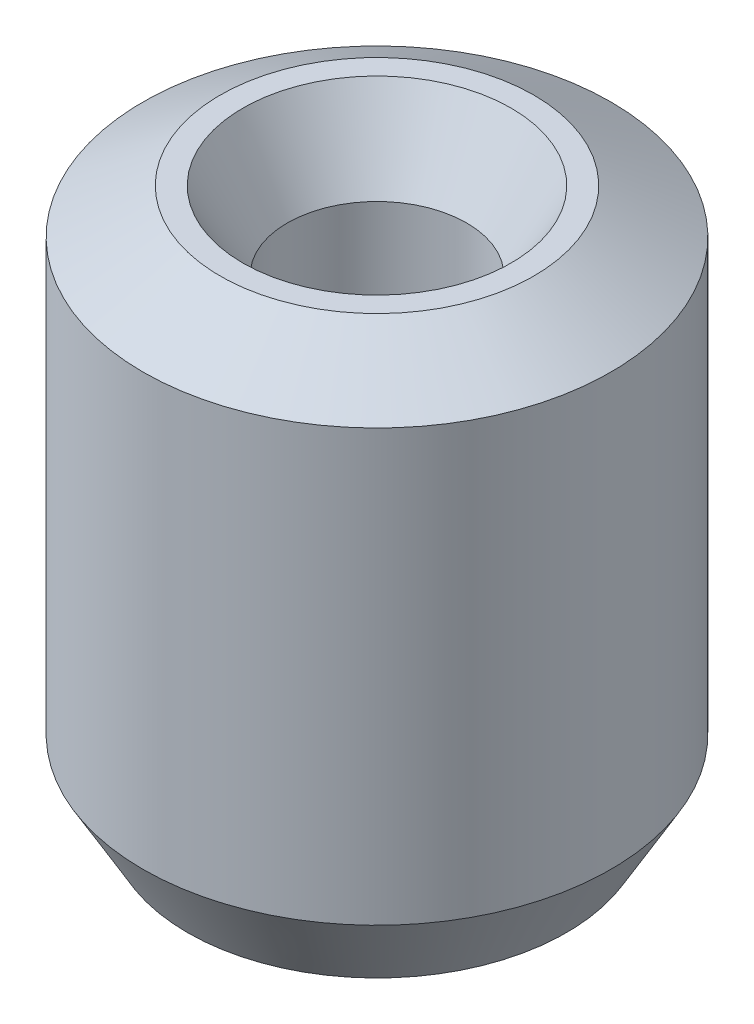
ISO-10303-21;
HEADER;
FILE_DESCRIPTION(('STEP AP214'),'2;1');
FILE_NAME('part.step','',(''),(''),'','','');
FILE_SCHEMA(('AUTOMOTIVE_DESIGN { 1 0 10303 214 1 1 1 1 }'));
ENDSEC;
DATA;
#1=APPLICATION_CONTEXT('core data for automotive mechanical design processes');
#2=APPLICATION_PROTOCOL_DEFINITION('international standard','automotive_design',2000,#1);
#3=PRODUCT_CONTEXT('',#1,'mechanical');
#4=PRODUCT('Part','Part','',(#3));
#5=PRODUCT_RELATED_PRODUCT_CATEGORY('part','',(#4));
#6=PRODUCT_DEFINITION_FORMATION('','',#4);
#7=PRODUCT_DEFINITION_CONTEXT('part definition',#1,'design');
#8=PRODUCT_DEFINITION('design','',#6,#7);
#9=PRODUCT_DEFINITION_SHAPE('','',#8);
#10=(LENGTH_UNIT() NAMED_UNIT(*) SI_UNIT(.MILLI.,.METRE.));
#11=(NAMED_UNIT(*) PLANE_ANGLE_UNIT() SI_UNIT($,.RADIAN.));
#12=(NAMED_UNIT(*) SI_UNIT($,.STERADIAN.) SOLID_ANGLE_UNIT());
#13=UNCERTAINTY_MEASURE_WITH_UNIT(LENGTH_MEASURE(1.E-05),#10,'distance_accuracy_value','');
#14=(GEOMETRIC_REPRESENTATION_CONTEXT(3) GLOBAL_UNCERTAINTY_ASSIGNED_CONTEXT((#13)) GLOBAL_UNIT_ASSIGNED_CONTEXT((#10,
#11,#12)) REPRESENTATION_CONTEXT('',''));
#15=CARTESIAN_POINT('',(0.,0.,0.));
#16=DIRECTION('',(0.,0.,1.));
#17=DIRECTION('',(1.,0.,0.));
#18=AXIS2_PLACEMENT_3D('',#15,#16,#17);
#19=CARTESIAN_POINT('',(0.,11.8047132954288,0.));
#20=DIRECTION('',(0.,-1.,0.));
#21=DIRECTION('',(0.,0.,-1.));
#22=AXIS2_PLACEMENT_3D('',#19,#20,#21);
#23=CYLINDRICAL_SURFACE('',#22,5.);
#24=CARTESIAN_POINT('',(0.,1.64882929491669,0.));
#25=DIRECTION('',(0.,1.,0.));
#26=DIRECTION('',(0.,0.,1.));
#27=AXIS2_PLACEMENT_3D('',#24,#25,#26);
#28=CIRCLE('',#27,5.);
#29=CARTESIAN_POINT('',(0.,1.64882929491669,5.));
#30=VERTEX_POINT('',#29);
#31=EDGE_CURVE('E10',#30,#30,#28,.T.);
#32=ORIENTED_EDGE('',*,*,#31,.T.);
#33=EDGE_LOOP('',(#32));
#34=FACE_BOUND('',#33,.T.);
#35=CARTESIAN_POINT('',(0.,10.8527612581609,0.));
#36=DIRECTION('',(0.,1.,0.));
#37=DIRECTION('',(0.,0.,1.));
#38=AXIS2_PLACEMENT_3D('',#35,#36,#37);
#39=CIRCLE('',#38,5.);
#40=CARTESIAN_POINT('',(0.,10.8527612581609,-5.));
#41=VERTEX_POINT('',#40);
#42=EDGE_CURVE('E50',#41,#41,#39,.F.);
#43=ORIENTED_EDGE('',*,*,#42,.T.);
#44=EDGE_LOOP('',(#43));
#45=FACE_BOUND('',#44,.T.);
#46=ADVANCED_FACE('F39',(#34,#45),#23,.T.);
#47=CARTESIAN_POINT('',(0.,11.8047132954288,0.));
#48=DIRECTION('',(0.,1.,0.));
#49=DIRECTION('',(0.,0.,1.));
#50=AXIS2_PLACEMENT_3D('',#47,#48,#49);
#51=PLANE('',#50);
#52=CARTESIAN_POINT('',(0.,11.8047132954288,0.));
#53=DIRECTION('',(0.,1.,0.));
#54=DIRECTION('',(0.,0.,1.));
#55=AXIS2_PLACEMENT_3D('',#52,#53,#54);
#56=CIRCLE('',#55,2.86784309189522);
#57=CARTESIAN_POINT('',(0.,11.8047132954288,2.86784309189522));
#58=VERTEX_POINT('',#57);
#59=EDGE_CURVE('E58',#58,#58,#56,.F.);
#60=ORIENTED_EDGE('',*,*,#59,.T.);
#61=EDGE_LOOP('',(#60));
#62=FACE_BOUND('',#61,.T.);
#63=CARTESIAN_POINT('',(0.,11.8047132954288,0.));
#64=DIRECTION('',(0.,1.,0.));
#65=DIRECTION('',(0.,0.,1.));
#66=AXIS2_PLACEMENT_3D('',#63,#64,#65);
#67=CIRCLE('',#66,3.35117070508332);
#68=CARTESIAN_POINT('',(0.,11.8047132954288,-3.35117070508332));
#69=VERTEX_POINT('',#68);
#70=EDGE_CURVE('E61',#69,#69,#67,.T.);
#71=ORIENTED_EDGE('',*,*,#70,.T.);
#72=EDGE_LOOP('',(#71));
#73=FACE_BOUND('',#72,.T.);
#74=ADVANCED_FACE('F88',(#62,#73),#51,.T.);
#75=CARTESIAN_POINT('',(0.,0.,0.));
#76=DIRECTION('',(0.,1.,0.));
#77=DIRECTION('',(0.,0.,1.));
#78=AXIS2_PLACEMENT_3D('',#75,#76,#77);
#79=PLANE('',#78);
#80=CARTESIAN_POINT('',(0.,0.,0.));
#81=DIRECTION('',(0.,1.,0.));
#82=DIRECTION('',(0.,0.,1.));
#83=AXIS2_PLACEMENT_3D('',#80,#81,#82);
#84=CIRCLE('',#83,3.56472034954401);
#85=CARTESIAN_POINT('',(0.,0.,-3.56472034954401));
#86=VERTEX_POINT('',#85);
#87=EDGE_CURVE('E51',#86,#86,#84,.T.);
#88=ORIENTED_EDGE('',*,*,#87,.T.);
#89=EDGE_LOOP('',(#88));
#90=FACE_BOUND('',#89,.T.);
#91=CARTESIAN_POINT('',(0.,0.,0.));
#92=DIRECTION('',(0.,1.,0.));
#93=DIRECTION('',(0.,0.,1.));
#94=AXIS2_PLACEMENT_3D('',#91,#92,#93);
#95=CIRCLE('',#94,4.0480479627321);
#96=CARTESIAN_POINT('',(0.,0.,4.0480479627321));
#97=VERTEX_POINT('',#96);
#98=EDGE_CURVE('E54',#97,#97,#95,.F.);
#99=ORIENTED_EDGE('',*,*,#98,.T.);
#100=EDGE_LOOP('',(#99));
#101=FACE_BOUND('',#100,.T.);
#102=ADVANCED_FACE('F83',(#90,#101),#79,.F.);
#103=CARTESIAN_POINT('',(0.,11.8047132954288,0.));
#104=DIRECTION('',(0.,-1.,0.));
#105=DIRECTION('',(0.,0.,-1.));
#106=AXIS2_PLACEMENT_3D('',#103,#104,#105);
#107=CYLINDRICAL_SURFACE('',#106,1.91589105462732);
#108=CARTESIAN_POINT('',(0.,10.1558840005121,0.));
#109=DIRECTION('',(0.,1.,0.));
#110=DIRECTION('',(0.,0.,1.));
#111=AXIS2_PLACEMENT_3D('',#108,#109,#110);
#112=CIRCLE('',#111,1.91589105462732);
#113=CARTESIAN_POINT('',(0.,10.1558840005121,1.91589105462732));
#114=VERTEX_POINT('',#113);
#115=EDGE_CURVE('E67',#114,#114,#112,.T.);
#116=ORIENTED_EDGE('',*,*,#115,.T.);
#117=EDGE_LOOP('',(#116));
#118=FACE_BOUND('',#117,.T.);
#119=CARTESIAN_POINT('',(0.,0.951952037267898,0.));
#120=DIRECTION('',(0.,1.,0.));
#121=DIRECTION('',(0.,0.,1.));
#122=AXIS2_PLACEMENT_3D('',#119,#120,#121);
#123=CIRCLE('',#122,1.91589105462732);
#124=CARTESIAN_POINT('',(0.,0.951952037267898,-1.91589105462732));
#125=VERTEX_POINT('',#124);
#126=EDGE_CURVE('E69',#125,#125,#123,.F.);
#127=ORIENTED_EDGE('',*,*,#126,.T.);
#128=EDGE_LOOP('',(#127));
#129=FACE_BOUND('',#128,.T.);
#130=ADVANCED_FACE('F71',(#118,#129),#107,.F.);
#131=CARTESIAN_POINT('',(0.,10.1558840005121,0.));
#132=DIRECTION('',(0.,1.,0.));
#133=DIRECTION('',(0.,0.,1.));
#134=AXIS2_PLACEMENT_3D('',#131,#132,#133);
#135=CONICAL_SURFACE('',#134,1.91589105462732,0.523598775598303);
#136=ORIENTED_EDGE('',*,*,#59,.F.);
#137=EDGE_LOOP('',(#136));
#138=FACE_BOUND('',#137,.T.);
#139=ORIENTED_EDGE('',*,*,#115,.F.);
#140=EDGE_LOOP('',(#139));
#141=FACE_BOUND('',#140,.T.);
#142=ADVANCED_FACE('F77',(#138,#141),#135,.F.);
#143=CARTESIAN_POINT('',(0.,0.,0.));
#144=DIRECTION('',(0.,-1.,0.));
#145=DIRECTION('',(0.,0.,-1.));
#146=AXIS2_PLACEMENT_3D('',#143,#144,#145);
#147=CONICAL_SURFACE('',#146,3.56472034954401,1.04719755119659);
#148=CARTESIAN_POINT('',(0.,0.951952037267898,-1.91589105462732));
#149=CARTESIAN_POINT('',(0.,0.942035870213024,-1.93306635978271));
#150=CARTESIAN_POINT('',(0.,0.93211970315815,-1.95024166493809));
#151=CARTESIAN_POINT('',(0.,0.912287369048402,-1.98459227524885));
#152=CARTESIAN_POINT('',(0.,0.902371201993528,-2.00176758040423));
#153=CARTESIAN_POINT('',(0.,0.88253886788378,-2.036118190715));
#154=CARTESIAN_POINT('',(0.,0.872622700828906,-2.05329349587038));
#155=CARTESIAN_POINT('',(0.,0.852790366719158,-2.08764410618115));
#156=CARTESIAN_POINT('',(0.,0.842874199664284,-2.10481941133653));
#157=CARTESIAN_POINT('',(0.,0.823041865554537,-2.13917002164729));
#158=CARTESIAN_POINT('',(0.,0.813125698499663,-2.15634532680267));
#159=CARTESIAN_POINT('',(0.,0.793293364389915,-2.19069593711344));
#160=CARTESIAN_POINT('',(0.,0.783377197335041,-2.20787124226882));
#161=CARTESIAN_POINT('',(0.,0.763544863225293,-2.24222185257958));
#162=CARTESIAN_POINT('',(0.,0.753628696170419,-2.25939715773497));
#163=CARTESIAN_POINT('',(0.,0.733796362060671,-2.29374776804573));
#164=CARTESIAN_POINT('',(0.,0.723880195005797,-2.31092307320111));
#165=CARTESIAN_POINT('',(0.,0.704047860896049,-2.34527368351188));
#166=CARTESIAN_POINT('',(0.,0.694131693841175,-2.36244898866726));
#167=CARTESIAN_POINT('',(0.,0.674299359731428,-2.39679959897802));
#168=CARTESIAN_POINT('',(0.,0.664383192676554,-2.41397490413341));
#169=CARTESIAN_POINT('',(0.,0.644550858566806,-2.44832551444417));
#170=CARTESIAN_POINT('',(0.,0.634634691511932,-2.46550081959955));
#171=CARTESIAN_POINT('',(0.,0.614802357402184,-2.49985142991032));
#172=CARTESIAN_POINT('',(0.,0.60488619034731,-2.5170267350657));
#173=CARTESIAN_POINT('',(0.,0.585053856237562,-2.55137734537646));
#174=CARTESIAN_POINT('',(0.,0.575137689182688,-2.56855265053185));
#175=CARTESIAN_POINT('',(0.,0.55530535507294,-2.60290326084261));
#176=CARTESIAN_POINT('',(0.,0.545389188018066,-2.62007856599799));
#177=CARTESIAN_POINT('',(0.,0.525556853908318,-2.65442917630876));
#178=CARTESIAN_POINT('',(0.,0.515640686853445,-2.67160448146414));
#179=CARTESIAN_POINT('',(0.,0.495808352743697,-2.7059550917749));
#180=CARTESIAN_POINT('',(0.,0.485892185688823,-2.72313039693029));
#181=CARTESIAN_POINT('',(0.,0.466059851579075,-2.75748100724105));
#182=CARTESIAN_POINT('',(0.,0.456143684524201,-2.77465631239643));
#183=CARTESIAN_POINT('',(0.,0.436311350414453,-2.8090069227072));
#184=CARTESIAN_POINT('',(0.,0.426395183359579,-2.82618222786258));
#185=CARTESIAN_POINT('',(0.,0.406562849249831,-2.86053283817334));
#186=CARTESIAN_POINT('',(0.,0.396646682194957,-2.87770814332872));
#187=CARTESIAN_POINT('',(0.,0.376814348085209,-2.91205875363949));
#188=CARTESIAN_POINT('',(0.,0.366898181030336,-2.92923405879487));
#189=CARTESIAN_POINT('',(0.,0.347065846920588,-2.96358466910564));
#190=CARTESIAN_POINT('',(0.,0.337149679865714,-2.98075997426102));
#191=CARTESIAN_POINT('',(0.,0.317317345755966,-3.01511058457178));
#192=CARTESIAN_POINT('',(0.,0.307401178701092,-3.03228588972716));
#193=CARTESIAN_POINT('',(0.,0.287568844591344,-3.06663650003793));
#194=CARTESIAN_POINT('',(0.,0.27765267753647,-3.08381180519331));
#195=CARTESIAN_POINT('',(0.,0.257820343426722,-3.11816241550407));
#196=CARTESIAN_POINT('',(0.,0.247904176371848,-3.13533772065946));
#197=CARTESIAN_POINT('',(0.,0.228071842262101,-3.16968833097022));
#198=CARTESIAN_POINT('',(0.,0.218155675207227,-3.1868636361256));
#199=CARTESIAN_POINT('',(0.,0.198323341097479,-3.22121424643637));
#200=CARTESIAN_POINT('',(0.,0.188407174042605,-3.23838955159175));
#201=CARTESIAN_POINT('',(0.,0.168574839932857,-3.27274016190251));
#202=CARTESIAN_POINT('',(0.,0.158658672877983,-3.2899154670579));
#203=CARTESIAN_POINT('',(0.,0.138826338768235,-3.32426607736866));
#204=CARTESIAN_POINT('',(0.,0.128910171713361,-3.34144138252404));
#205=CARTESIAN_POINT('',(0.,0.109077837603613,-3.37579199283481));
#206=CARTESIAN_POINT('',(0.,0.0991616705487394,-3.39296729799019));
#207=CARTESIAN_POINT('',(0.,0.0793293364389915,-3.42731790830095));
#208=CARTESIAN_POINT('',(0.,0.0694131693841176,-3.44449321345634));
#209=CARTESIAN_POINT('',(0.,0.0495808352743697,-3.4788438237671));
#210=CARTESIAN_POINT('',(0.,0.0396646682194957,-3.49601912892248));
#211=CARTESIAN_POINT('',(0.,0.0198323341097479,-3.53036973923325));
#212=CARTESIAN_POINT('',(0.,0.00991616705487395,-3.54754504438863));
#213=CARTESIAN_POINT('',(0.,0.,-3.56472034954401));
#214=B_SPLINE_CURVE_WITH_KNOTS('',3,(#148,#149,#150,#151,#152,#153,#154,#155,#156,#157,#158,
#159,#160,#161,#162,#163,#164,#165,#166,#167,#168,#169,#170,#171,#172,#173,#174,#175,#176,#177,
#178,#179,#180,#181,#182,#183,#184,#185,#186,#187,#188,#189,#190,#191,#192,#193,#194,#195,#196,
#197,#198,#199,#200,#201,#202,#203,#204,#205,#206,#207,#208,#209,#210,#211,#212,#213),
.UNSPECIFIED.,.F.,.F.,(4,2,2,2,2,2,2,2,2,2,2,2,2,2,2,2,2,2,2,2,2,2,2,2,2,2,2,2,2,2,2,2,4),(0.,
0.059497002329243,0.118994004658486,0.17849100698773,0.237988009316973,0.297485011646216,
0.356982013975459,0.416479016304703,0.475976018633946,0.535473020963189,0.594970023292432,
0.654467025621676,0.713964027950919,0.773461030280162,0.832958032609405,0.892455034938648,
0.951952037267892,1.01144903959713,1.07094604192638,1.13044304425562,1.18994004658486,
1.24943704891411,1.30893405124335,1.36843105357259,1.42792805590184,1.48742505823108,
1.54692206056032,1.60641906288957,1.66591606521881,1.72541306754805,1.7849100698773,
1.84440707220654,1.90390407453578),.UNSPECIFIED.);
#215=EDGE_CURVE('BSEAM73',#125,#86,#214,.T.);
#216=ORIENTED_EDGE('',*,*,#126,.F.);
#217=ORIENTED_EDGE('',*,*,#87,.F.);
#218=ORIENTED_EDGE('',*,*,#215,.T.);
#219=ORIENTED_EDGE('',*,*,#215,.F.);
#220=EDGE_LOOP('',(#216,#218,#217,#219));
#221=FACE_BOUND('',#220,.T.);
#222=ADVANCED_FACE('F73',(#221),#147,.F.);
#223=CARTESIAN_POINT('',(0.,1.64882929491669,0.));
#224=DIRECTION('',(0.,1.,0.));
#225=DIRECTION('',(0.,0.,1.));
#226=AXIS2_PLACEMENT_3D('',#223,#224,#225);
#227=CONICAL_SURFACE('',#226,5.,0.523598775598303);
#228=ORIENTED_EDGE('',*,*,#98,.F.);
#229=EDGE_LOOP('',(#228));
#230=FACE_BOUND('',#229,.T.);
#231=ORIENTED_EDGE('',*,*,#31,.F.);
#232=EDGE_LOOP('',(#231));
#233=FACE_BOUND('',#232,.T.);
#234=ADVANCED_FACE('F76',(#230,#233),#227,.T.);
#235=CARTESIAN_POINT('',(0.,11.8047132954288,0.));
#236=DIRECTION('',(0.,-1.,0.));
#237=DIRECTION('',(0.,0.,-1.));
#238=AXIS2_PLACEMENT_3D('',#235,#236,#237);
#239=CONICAL_SURFACE('',#238,3.35117070508332,1.04719755119659);
#240=CARTESIAN_POINT('',(0.,10.8527612581609,-5.));
#241=CARTESIAN_POINT('',(0.,10.8626774252157,-4.98282469484462));
#242=CARTESIAN_POINT('',(0.,10.8725935922706,-4.96564938968924));
#243=CARTESIAN_POINT('',(0.,10.8924259263804,-4.93129877937847));
#244=CARTESIAN_POINT('',(0.,10.9023420934352,-4.91412347422309));
#245=CARTESIAN_POINT('',(0.,10.922174427545,-4.87977286391233));
#246=CARTESIAN_POINT('',(0.,10.9320905945998,-4.86259755875694));
#247=CARTESIAN_POINT('',(0.,10.9519229287096,-4.82824694844618));
#248=CARTESIAN_POINT('',(0.,10.9618390957645,-4.8110716432908));
#249=CARTESIAN_POINT('',(0.,10.9816714298742,-4.77672103298003));
#250=CARTESIAN_POINT('',(0.,10.9915875969291,-4.75954572782465));
#251=CARTESIAN_POINT('',(0.,11.0114199310388,-4.72519511751389));
#252=CARTESIAN_POINT('',(0.,11.0213360980937,-4.70801981235851));
#253=CARTESIAN_POINT('',(0.,11.0411684322035,-4.67366920204774));
#254=CARTESIAN_POINT('',(0.,11.0510845992583,-4.65649389689236));
#255=CARTESIAN_POINT('',(0.,11.0709169333681,-4.6221432865816));
#256=CARTESIAN_POINT('',(0.,11.080833100423,-4.60496798142621));
#257=CARTESIAN_POINT('',(0.,11.1006654345327,-4.57061737111545));
#258=CARTESIAN_POINT('',(0.,11.1105816015876,-4.55344206596007));
#259=CARTESIAN_POINT('',(0.,11.1304139356973,-4.5190914556493));
#260=CARTESIAN_POINT('',(0.,11.1403301027522,-4.50191615049392));
#261=CARTESIAN_POINT('',(0.,11.1601624368619,-4.46756554018316));
#262=CARTESIAN_POINT('',(0.,11.1700786039168,-4.45039023502777));
#263=CARTESIAN_POINT('',(0.,11.1899109380266,-4.41603962471701));
#264=CARTESIAN_POINT('',(0.,11.1998271050814,-4.39886431956163));
#265=CARTESIAN_POINT('',(0.,11.2196594391912,-4.36451370925086));
#266=CARTESIAN_POINT('',(0.,11.2295756062461,-4.34733840409548));
#267=CARTESIAN_POINT('',(0.,11.2494079403558,-4.31298779378472));
#268=CARTESIAN_POINT('',(0.,11.2593241074107,-4.29581248862933));
#269=CARTESIAN_POINT('',(0.,11.2791564415204,-4.26146187831857));
#270=CARTESIAN_POINT('',(0.,11.2890726085753,-4.24428657316319));
#271=CARTESIAN_POINT('',(0.,11.3089049426851,-4.20993596285242));
#272=CARTESIAN_POINT('',(0.,11.3188211097399,-4.19276065769704));
#273=CARTESIAN_POINT('',(0.,11.3386534438497,-4.15841004738628));
#274=CARTESIAN_POINT('',(0.,11.3485696109046,-4.1412347422309));
#275=CARTESIAN_POINT('',(0.,11.3684019450143,-4.10688413192013));
#276=CARTESIAN_POINT('',(0.,11.3783181120692,-4.08970882676475));
#277=CARTESIAN_POINT('',(0.,11.3981504461789,-4.05535821645398));
#278=CARTESIAN_POINT('',(0.,11.4080666132338,-4.0381829112986));
#279=CARTESIAN_POINT('',(0.,11.4278989473435,-4.00383230098784));
#280=CARTESIAN_POINT('',(0.,11.4378151143984,-3.98665699583246));
#281=CARTESIAN_POINT('',(0.,11.4576474485082,-3.95230638552169));
#282=CARTESIAN_POINT('',(0.,11.467563615563,-3.93513108036631));
#283=CARTESIAN_POINT('',(0.,11.4873959496728,-3.90078047005555));
#284=CARTESIAN_POINT('',(0.,11.4973121167277,-3.88360516490016));
#285=CARTESIAN_POINT('',(0.,11.5171444508374,-3.8492545545894));
#286=CARTESIAN_POINT('',(0.,11.5270606178923,-3.83207924943402));
#287=CARTESIAN_POINT('',(0.,11.546892952002,-3.79772863912325));
#288=CARTESIAN_POINT('',(0.,11.5568091190569,-3.78055333396787));
#289=CARTESIAN_POINT('',(0.,11.5766414531667,-3.74620272365711));
#290=CARTESIAN_POINT('',(0.,11.5865576202215,-3.72902741850172));
#291=CARTESIAN_POINT('',(0.,11.6063899543313,-3.69467680819096));
#292=CARTESIAN_POINT('',(0.,11.6163061213861,-3.67750150303558));
#293=CARTESIAN_POINT('',(0.,11.6361384554959,-3.64315089272481));
#294=CARTESIAN_POINT('',(0.,11.6460546225508,-3.62597558756943));
#295=CARTESIAN_POINT('',(0.,11.6658869566605,-3.59162497725867));
#296=CARTESIAN_POINT('',(0.,11.6758031237154,-3.57444967210328));
#297=CARTESIAN_POINT('',(0.,11.6956354578251,-3.54009906179252));
#298=CARTESIAN_POINT('',(0.,11.70555162488,-3.52292375663714));
#299=CARTESIAN_POINT('',(0.,11.7253839589898,-3.48857314632637));
#300=CARTESIAN_POINT('',(0.,11.7353001260446,-3.47139784117099));
#301=CARTESIAN_POINT('',(0.,11.7551324601544,-3.43704723086023));
#302=CARTESIAN_POINT('',(0.,11.7650486272093,-3.41987192570484));
#303=CARTESIAN_POINT('',(0.,11.784880961319,-3.38552131539408));
#304=CARTESIAN_POINT('',(0.,11.7947971283739,-3.3683460102387));
#305=CARTESIAN_POINT('',(0.,11.8047132954288,-3.35117070508332));
#306=B_SPLINE_CURVE_WITH_KNOTS('',3,(#240,#241,#242,#243,#244,#245,#246,#247,#248,#249,#250,
#251,#252,#253,#254,#255,#256,#257,#258,#259,#260,#261,#262,#263,#264,#265,#266,#267,#268,#269,
#270,#271,#272,#273,#274,#275,#276,#277,#278,#279,#280,#281,#282,#283,#284,#285,#286,#287,#288,
#289,#290,#291,#292,#293,#294,#295,#296,#297,#298,#299,#300,#301,#302,#303,#304,#305),
.UNSPECIFIED.,.F.,.F.,(4,2,2,2,2,2,2,2,2,2,2,2,2,2,2,2,2,2,2,2,2,2,2,2,2,2,2,2,2,2,2,2,4),(0.,
0.0594970023292441,0.118994004658487,0.17849100698773,0.237988009316973,0.297485011646216,
0.35698201397546,0.416479016304703,0.475976018633946,0.53547302096319,0.594970023292432,
0.654467025621675,0.713964027950919,0.773461030280162,0.832958032609405,0.892455034938649,
0.951952037267892,1.01144903959713,1.07094604192638,1.13044304425562,1.18994004658487,
1.24943704891411,1.30893405124335,1.36843105357259,1.42792805590184,1.48742505823108,
1.54692206056032,1.60641906288957,1.66591606521881,1.72541306754805,1.7849100698773,
1.84440707220654,1.90390407453578),.UNSPECIFIED.);
#307=EDGE_CURVE('BSEAM45',#41,#69,#306,.T.);
#308=ORIENTED_EDGE('',*,*,#42,.F.);
#309=ORIENTED_EDGE('',*,*,#70,.F.);
#310=ORIENTED_EDGE('',*,*,#307,.T.);
#311=ORIENTED_EDGE('',*,*,#307,.F.);
#312=EDGE_LOOP('',(#308,#310,#309,#311));
#313=FACE_BOUND('',#312,.T.);
#314=ADVANCED_FACE('F45',(#313),#239,.T.);
#315=CLOSED_SHELL('',(#46,#74,#102,#130,#142,#222,#234,#314));
#316=MANIFOLD_SOLID_BREP('B2',#315);
#317=ADVANCED_BREP_SHAPE_REPRESENTATION('',(#18,#316),#14);
#318=SHAPE_DEFINITION_REPRESENTATION(#9,#317);
ENDSEC;
END-ISO-10303-21;
